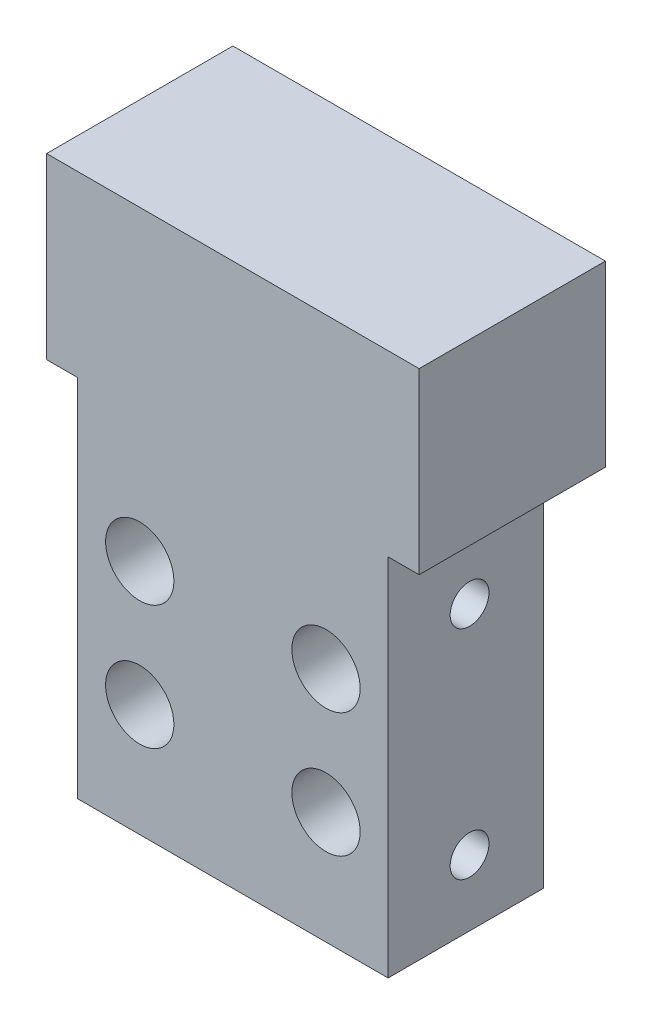
ISO-10303-21;
HEADER;
FILE_DESCRIPTION(('STEP AP214'),'2;1');
FILE_NAME('part.step','',(''),(''),'','','');
FILE_SCHEMA(('AUTOMOTIVE_DESIGN { 1 0 10303 214 1 1 1 1 }'));
ENDSEC;
DATA;
#1=APPLICATION_CONTEXT('core data for automotive mechanical design processes');
#2=APPLICATION_PROTOCOL_DEFINITION('international standard','automotive_design',2000,#1);
#3=PRODUCT_CONTEXT('',#1,'mechanical');
#4=PRODUCT('Part','Part','',(#3));
#5=PRODUCT_RELATED_PRODUCT_CATEGORY('part','',(#4));
#6=PRODUCT_DEFINITION_FORMATION('','',#4);
#7=PRODUCT_DEFINITION_CONTEXT('part definition',#1,'design');
#8=PRODUCT_DEFINITION('design','',#6,#7);
#9=PRODUCT_DEFINITION_SHAPE('','',#8);
#10=(LENGTH_UNIT() NAMED_UNIT(*) SI_UNIT(.MILLI.,.METRE.));
#11=(NAMED_UNIT(*) PLANE_ANGLE_UNIT() SI_UNIT($,.RADIAN.));
#12=(NAMED_UNIT(*) SI_UNIT($,.STERADIAN.) SOLID_ANGLE_UNIT());
#13=UNCERTAINTY_MEASURE_WITH_UNIT(LENGTH_MEASURE(1.E-05),#10,'distance_accuracy_value','');
#14=(GEOMETRIC_REPRESENTATION_CONTEXT(3) GLOBAL_UNCERTAINTY_ASSIGNED_CONTEXT((#13)) GLOBAL_UNIT_ASSIGNED_CONTEXT((#10,
#11,#12)) REPRESENTATION_CONTEXT('',''));
#15=CARTESIAN_POINT('',(0.,0.,0.));
#16=DIRECTION('',(0.,0.,1.));
#17=DIRECTION('',(1.,0.,0.));
#18=AXIS2_PLACEMENT_3D('',#15,#16,#17);
#19=CARTESIAN_POINT('',(0.,0.,10.));
#20=DIRECTION('',(1.,0.,0.));
#21=DIRECTION('',(0.,1.,0.));
#22=AXIS2_PLACEMENT_3D('',#19,#20,#21);
#23=PLANE('',#22);
#24=CARTESIAN_POINT('',(0.,18.25,4.75184368188925));
#25=DIRECTION('',(-1.,0.,0.));
#26=DIRECTION('',(0.,0.,1.));
#27=AXIS2_PLACEMENT_3D('',#24,#25,#26);
#28=CIRCLE('',#27,1.24999999999999);
#29=CARTESIAN_POINT('',(0.,18.25,6.00184368188924));
#30=VERTEX_POINT('',#29);
#31=EDGE_CURVE('E243',#30,#30,#28,.T.);
#32=ORIENTED_EDGE('',*,*,#31,.F.);
#33=EDGE_LOOP('',(#32));
#34=FACE_BOUND('',#33,.T.);
#35=CARTESIAN_POINT('',(0.,4.25000000000001,4.75184368188906));
#36=DIRECTION('',(-1.,0.,0.));
#37=DIRECTION('',(0.,0.,1.));
#38=AXIS2_PLACEMENT_3D('',#35,#36,#37);
#39=CIRCLE('',#38,1.24999999999999);
#40=CARTESIAN_POINT('',(0.,4.25000000000001,6.00184368188905));
#41=VERTEX_POINT('',#40);
#42=EDGE_CURVE('E235',#41,#41,#39,.T.);
#43=ORIENTED_EDGE('',*,*,#42,.F.);
#44=EDGE_LOOP('',(#43));
#45=FACE_BOUND('',#44,.T.);
#46=DIRECTION('',(0.,-1.,0.));
#47=VECTOR('',#46,1.);
#48=CARTESIAN_POINT('',(0.,0.,0.));
#49=LINE('',#48,#47);
#50=CARTESIAN_POINT('',(0.,23.5,0.));
#51=VERTEX_POINT('',#50);
#52=CARTESIAN_POINT('',(0.,0.,0.));
#53=VERTEX_POINT('',#52);
#54=EDGE_CURVE('E91',#51,#53,#49,.T.);
#55=ORIENTED_EDGE('',*,*,#54,.T.);
#56=DIRECTION('',(0.,0.,-1.));
#57=VECTOR('',#56,1.);
#58=CARTESIAN_POINT('',(0.,0.,10.));
#59=LINE('',#58,#57);
#60=CARTESIAN_POINT('',(0.,0.,10.));
#61=VERTEX_POINT('',#60);
#62=EDGE_CURVE('E11',#61,#53,#59,.T.);
#63=ORIENTED_EDGE('',*,*,#62,.F.);
#64=DIRECTION('',(0.,-1.,0.));
#65=VECTOR('',#64,1.);
#66=CARTESIAN_POINT('',(0.,0.,10.));
#67=LINE('',#66,#65);
#68=CARTESIAN_POINT('',(0.,23.5,10.));
#69=VERTEX_POINT('',#68);
#70=EDGE_CURVE('E106',#69,#61,#67,.T.);
#71=ORIENTED_EDGE('',*,*,#70,.F.);
#72=DIRECTION('',(0.,0.,1.));
#73=VECTOR('',#72,1.);
#74=CARTESIAN_POINT('',(0.,23.5,0.));
#75=LINE('',#74,#73);
#76=EDGE_CURVE('E266',#51,#69,#75,.T.);
#77=ORIENTED_EDGE('',*,*,#76,.F.);
#78=EDGE_LOOP('',(#55,#63,#71,#77));
#79=FACE_BOUND('',#78,.T.);
#80=ADVANCED_FACE('F38',(#34,#45,#79),#23,.F.);
#81=CARTESIAN_POINT('',(0.,0.,10.));
#82=DIRECTION('',(0.,1.,0.));
#83=DIRECTION('',(0.,0.,1.));
#84=AXIS2_PLACEMENT_3D('',#81,#82,#83);
#85=PLANE('',#84);
#86=DIRECTION('',(1.,0.,0.));
#87=VECTOR('',#86,1.);
#88=CARTESIAN_POINT('',(0.,0.,0.));
#89=LINE('',#88,#87);
#90=CARTESIAN_POINT('',(20.,0.,0.));
#91=VERTEX_POINT('',#90);
#92=EDGE_CURVE('E80',#53,#91,#89,.T.);
#93=ORIENTED_EDGE('',*,*,#92,.T.);
#94=DIRECTION('',(0.,0.,-1.));
#95=VECTOR('',#94,1.);
#96=CARTESIAN_POINT('',(20.,0.,10.));
#97=LINE('',#96,#95);
#98=CARTESIAN_POINT('',(20.,0.,10.));
#99=VERTEX_POINT('',#98);
#100=EDGE_CURVE('E46',#99,#91,#97,.T.);
#101=ORIENTED_EDGE('',*,*,#100,.F.);
#102=DIRECTION('',(1.,0.,0.));
#103=VECTOR('',#102,1.);
#104=CARTESIAN_POINT('',(0.,0.,10.));
#105=LINE('',#104,#103);
#106=EDGE_CURVE('E68',#61,#99,#105,.T.);
#107=ORIENTED_EDGE('',*,*,#106,.F.);
#108=ORIENTED_EDGE('',*,*,#62,.T.);
#109=EDGE_LOOP('',(#93,#101,#107,#108));
#110=FACE_BOUND('',#109,.T.);
#111=ADVANCED_FACE('F82',(#110),#85,.F.);
#112=CARTESIAN_POINT('',(20.,0.,10.));
#113=DIRECTION('',(-1.,0.,0.));
#114=DIRECTION('',(0.,-1.,0.));
#115=AXIS2_PLACEMENT_3D('',#112,#113,#114);
#116=PLANE('',#115);
#117=CARTESIAN_POINT('',(20.,18.25,4.75184368188925));
#118=DIRECTION('',(1.,0.,0.));
#119=DIRECTION('',(0.,0.,-1.));
#120=AXIS2_PLACEMENT_3D('',#117,#118,#119);
#121=CIRCLE('',#120,1.24999999999999);
#122=CARTESIAN_POINT('',(20.,18.25,3.50184368188926));
#123=VERTEX_POINT('',#122);
#124=EDGE_CURVE('E227',#123,#123,#121,.T.);
#125=ORIENTED_EDGE('',*,*,#124,.F.);
#126=EDGE_LOOP('',(#125));
#127=FACE_BOUND('',#126,.T.);
#128=CARTESIAN_POINT('',(20.,4.25000000000002,4.75184368188906));
#129=DIRECTION('',(1.,0.,0.));
#130=DIRECTION('',(0.,0.,-1.));
#131=AXIS2_PLACEMENT_3D('',#128,#129,#130);
#132=CIRCLE('',#131,1.24999999999999);
#133=CARTESIAN_POINT('',(20.,4.25000000000002,3.50184368188908));
#134=VERTEX_POINT('',#133);
#135=EDGE_CURVE('E219',#134,#134,#132,.T.);
#136=ORIENTED_EDGE('',*,*,#135,.F.);
#137=EDGE_LOOP('',(#136));
#138=FACE_BOUND('',#137,.T.);
#139=DIRECTION('',(0.,1.,0.));
#140=VECTOR('',#139,1.);
#141=CARTESIAN_POINT('',(20.,0.,0.));
#142=LINE('',#141,#140);
#143=CARTESIAN_POINT('',(20.,23.5,0.));
#144=VERTEX_POINT('',#143);
#145=EDGE_CURVE('E90',#91,#144,#142,.T.);
#146=ORIENTED_EDGE('',*,*,#145,.T.);
#147=DIRECTION('',(0.,0.,-1.));
#148=VECTOR('',#147,1.);
#149=CARTESIAN_POINT('',(20.,23.5,10.));
#150=LINE('',#149,#148);
#151=CARTESIAN_POINT('',(20.,23.5,10.));
#152=VERTEX_POINT('',#151);
#153=EDGE_CURVE('E247',#152,#144,#150,.T.);
#154=ORIENTED_EDGE('',*,*,#153,.F.);
#155=DIRECTION('',(0.,1.,0.));
#156=VECTOR('',#155,1.);
#157=CARTESIAN_POINT('',(20.,0.,10.));
#158=LINE('',#157,#156);
#159=EDGE_CURVE('E99',#99,#152,#158,.T.);
#160=ORIENTED_EDGE('',*,*,#159,.F.);
#161=ORIENTED_EDGE('',*,*,#100,.T.);
#162=EDGE_LOOP('',(#146,#154,#160,#161));
#163=FACE_BOUND('',#162,.T.);
#164=ADVANCED_FACE('F95',(#127,#138,#163),#116,.F.);
#165=CARTESIAN_POINT('',(0.,0.,10.));
#166=DIRECTION('',(0.,0.,-1.));
#167=DIRECTION('',(-1.,0.,0.));
#168=AXIS2_PLACEMENT_3D('',#165,#166,#167);
#169=PLANE('',#168);
#170=CARTESIAN_POINT('',(3.99999999999999,15.25,10.));
#171=DIRECTION('',(0.,0.,1.));
#172=DIRECTION('',(1.,0.,0.));
#173=AXIS2_PLACEMENT_3D('',#170,#171,#172);
#174=CIRCLE('',#173,2.2);
#175=CARTESIAN_POINT('',(6.19999999999999,15.25,10.));
#176=VERTEX_POINT('',#175);
#177=EDGE_CURVE('E179',#176,#176,#174,.T.);
#178=ORIENTED_EDGE('',*,*,#177,.F.);
#179=EDGE_LOOP('',(#178));
#180=FACE_BOUND('',#179,.T.);
#181=CARTESIAN_POINT('',(16.,15.25,10.));
#182=DIRECTION('',(0.,0.,1.));
#183=DIRECTION('',(1.,0.,0.));
#184=AXIS2_PLACEMENT_3D('',#181,#182,#183);
#185=CIRCLE('',#184,2.2);
#186=CARTESIAN_POINT('',(18.2,15.25,10.));
#187=VERTEX_POINT('',#186);
#188=EDGE_CURVE('E163',#187,#187,#185,.T.);
#189=ORIENTED_EDGE('',*,*,#188,.F.);
#190=EDGE_LOOP('',(#189));
#191=FACE_BOUND('',#190,.T.);
#192=CARTESIAN_POINT('',(16.0000000000001,7.25,10.));
#193=DIRECTION('',(0.,0.,1.));
#194=DIRECTION('',(1.,0.,0.));
#195=AXIS2_PLACEMENT_3D('',#192,#193,#194);
#196=CIRCLE('',#195,2.2);
#197=CARTESIAN_POINT('',(18.2000000000001,7.25,10.));
#198=VERTEX_POINT('',#197);
#199=EDGE_CURVE('E147',#198,#198,#196,.T.);
#200=ORIENTED_EDGE('',*,*,#199,.F.);
#201=EDGE_LOOP('',(#200));
#202=FACE_BOUND('',#201,.T.);
#203=CARTESIAN_POINT('',(4.00000000000008,7.25,10.));
#204=DIRECTION('',(0.,0.,1.));
#205=DIRECTION('',(1.,0.,0.));
#206=AXIS2_PLACEMENT_3D('',#203,#204,#205);
#207=CIRCLE('',#206,2.2);
#208=CARTESIAN_POINT('',(6.20000000000008,7.25,10.));
#209=VERTEX_POINT('',#208);
#210=EDGE_CURVE('E131',#209,#209,#207,.T.);
#211=ORIENTED_EDGE('',*,*,#210,.F.);
#212=EDGE_LOOP('',(#211));
#213=FACE_BOUND('',#212,.T.);
#214=DIRECTION('',(-1.,0.,0.));
#215=VECTOR('',#214,1.);
#216=CARTESIAN_POINT('',(0.,23.5,10.));
#217=LINE('',#216,#215);
#218=CARTESIAN_POINT('',(-2.,23.5,10.));
#219=VERTEX_POINT('',#218);
#220=EDGE_CURVE('E56',#69,#219,#217,.T.);
#221=ORIENTED_EDGE('',*,*,#220,.F.);
#222=ORIENTED_EDGE('',*,*,#70,.T.);
#223=ORIENTED_EDGE('',*,*,#106,.T.);
#224=ORIENTED_EDGE('',*,*,#159,.T.);
#225=DIRECTION('',(-1.,0.,0.));
#226=VECTOR('',#225,1.);
#227=CARTESIAN_POINT('',(22.,23.5,10.));
#228=LINE('',#227,#226);
#229=CARTESIAN_POINT('',(22.,23.5,10.));
#230=VERTEX_POINT('',#229);
#231=EDGE_CURVE('E249',#230,#152,#228,.T.);
#232=ORIENTED_EDGE('',*,*,#231,.F.);
#233=DIRECTION('',(0.,-1.,0.));
#234=VECTOR('',#233,1.);
#235=CARTESIAN_POINT('',(22.,35.,10.));
#236=LINE('',#235,#234);
#237=CARTESIAN_POINT('',(22.,35.,10.));
#238=VERTEX_POINT('',#237);
#239=EDGE_CURVE('E195',#238,#230,#236,.T.);
#240=ORIENTED_EDGE('',*,*,#239,.F.);
#241=DIRECTION('',(1.,0.,0.));
#242=VECTOR('',#241,1.);
#243=CARTESIAN_POINT('',(22.,35.,10.));
#244=LINE('',#243,#242);
#245=CARTESIAN_POINT('',(-2.,35.,10.));
#246=VERTEX_POINT('',#245);
#247=EDGE_CURVE('E199',#246,#238,#244,.T.);
#248=ORIENTED_EDGE('',*,*,#247,.F.);
#249=DIRECTION('',(0.,-1.,0.));
#250=VECTOR('',#249,1.);
#251=CARTESIAN_POINT('',(-2.,35.,10.));
#252=LINE('',#251,#250);
#253=EDGE_CURVE('E191',#246,#219,#252,.T.);
#254=ORIENTED_EDGE('',*,*,#253,.T.);
#255=EDGE_LOOP('',(#221,#222,#223,#224,#232,#240,#248,#254));
#256=FACE_BOUND('',#255,.T.);
#257=ADVANCED_FACE('F326',(#180,#191,#202,#213,#256),#169,.F.);
#258=CARTESIAN_POINT('',(0.,0.,0.));
#259=DIRECTION('',(0.,0.,-1.));
#260=DIRECTION('',(-1.,0.,0.));
#261=AXIS2_PLACEMENT_3D('',#258,#259,#260);
#262=PLANE('',#261);
#263=CARTESIAN_POINT('',(3.99999999999999,15.25,0.));
#264=DIRECTION('',(0.,0.,1.));
#265=DIRECTION('',(1.,0.,0.));
#266=AXIS2_PLACEMENT_3D('',#263,#264,#265);
#267=CIRCLE('',#266,1.2);
#268=CARTESIAN_POINT('',(5.19999999999999,15.25,0.));
#269=VERTEX_POINT('',#268);
#270=EDGE_CURVE('E167',#269,#269,#267,.T.);
#271=ORIENTED_EDGE('',*,*,#270,.T.);
#272=EDGE_LOOP('',(#271));
#273=FACE_BOUND('',#272,.T.);
#274=CARTESIAN_POINT('',(16.,15.25,0.));
#275=DIRECTION('',(0.,0.,1.));
#276=DIRECTION('',(1.,0.,0.));
#277=AXIS2_PLACEMENT_3D('',#274,#275,#276);
#278=CIRCLE('',#277,1.2);
#279=CARTESIAN_POINT('',(17.2,15.25,0.));
#280=VERTEX_POINT('',#279);
#281=EDGE_CURVE('E151',#280,#280,#278,.T.);
#282=ORIENTED_EDGE('',*,*,#281,.T.);
#283=EDGE_LOOP('',(#282));
#284=FACE_BOUND('',#283,.T.);
#285=CARTESIAN_POINT('',(16.0000000000001,7.25,0.));
#286=DIRECTION('',(0.,0.,1.));
#287=DIRECTION('',(1.,0.,0.));
#288=AXIS2_PLACEMENT_3D('',#285,#286,#287);
#289=CIRCLE('',#288,1.2);
#290=CARTESIAN_POINT('',(17.2000000000001,7.25,0.));
#291=VERTEX_POINT('',#290);
#292=EDGE_CURVE('E135',#291,#291,#289,.T.);
#293=ORIENTED_EDGE('',*,*,#292,.T.);
#294=EDGE_LOOP('',(#293));
#295=FACE_BOUND('',#294,.T.);
#296=CARTESIAN_POINT('',(4.00000000000008,7.25,0.));
#297=DIRECTION('',(0.,0.,1.));
#298=DIRECTION('',(1.,0.,0.));
#299=AXIS2_PLACEMENT_3D('',#296,#297,#298);
#300=CIRCLE('',#299,1.2);
#301=CARTESIAN_POINT('',(5.20000000000007,7.25,0.));
#302=VERTEX_POINT('',#301);
#303=EDGE_CURVE('E115',#302,#302,#300,.T.);
#304=ORIENTED_EDGE('',*,*,#303,.T.);
#305=EDGE_LOOP('',(#304));
#306=FACE_BOUND('',#305,.T.);
#307=ORIENTED_EDGE('',*,*,#54,.F.);
#308=DIRECTION('',(-1.,0.,0.));
#309=VECTOR('',#308,1.);
#310=CARTESIAN_POINT('',(20.,23.5,0.));
#311=LINE('',#310,#309);
#312=EDGE_CURVE('E103',#144,#51,#311,.T.);
#313=ORIENTED_EDGE('',*,*,#312,.F.);
#314=ORIENTED_EDGE('',*,*,#145,.F.);
#315=ORIENTED_EDGE('',*,*,#92,.F.);
#316=EDGE_LOOP('',(#307,#313,#314,#315));
#317=FACE_BOUND('',#316,.T.);
#318=ADVANCED_FACE('F101',(#273,#284,#295,#306,#317),#262,.T.);
#319=CARTESIAN_POINT('',(4.00000000000008,7.25,10.));
#320=DIRECTION('',(0.,0.,1.));
#321=DIRECTION('',(1.,0.,0.));
#322=AXIS2_PLACEMENT_3D('',#319,#320,#321);
#323=CYLINDRICAL_SURFACE('',#322,1.2);
#324=ORIENTED_EDGE('',*,*,#303,.F.);
#325=EDGE_LOOP('',(#324));
#326=FACE_BOUND('',#325,.T.);
#327=CARTESIAN_POINT('',(4.00000000000008,7.25,6.));
#328=DIRECTION('',(0.,0.,1.));
#329=DIRECTION('',(1.,0.,0.));
#330=AXIS2_PLACEMENT_3D('',#327,#328,#329);
#331=CIRCLE('',#330,1.2);
#332=CARTESIAN_POINT('',(5.20000000000008,7.25,6.));
#333=VERTEX_POINT('',#332);
#334=EDGE_CURVE('E123',#333,#333,#331,.T.);
#335=ORIENTED_EDGE('',*,*,#334,.T.);
#336=EDGE_LOOP('',(#335));
#337=FACE_BOUND('',#336,.T.);
#338=ADVANCED_FACE('F431',(#326,#337),#323,.F.);
#339=CARTESIAN_POINT('',(5.20000000000008,7.25,6.));
#340=DIRECTION('',(0.,0.,-1.));
#341=DIRECTION('',(-1.,0.,0.));
#342=AXIS2_PLACEMENT_3D('',#339,#340,#341);
#343=PLANE('',#342);
#344=ORIENTED_EDGE('',*,*,#334,.F.);
#345=EDGE_LOOP('',(#344));
#346=FACE_BOUND('',#345,.T.);
#347=CARTESIAN_POINT('',(4.00000000000008,7.25,6.));
#348=DIRECTION('',(0.,0.,1.));
#349=DIRECTION('',(1.,0.,0.));
#350=AXIS2_PLACEMENT_3D('',#347,#348,#349);
#351=CIRCLE('',#350,2.2);
#352=CARTESIAN_POINT('',(6.20000000000008,7.25,6.));
#353=VERTEX_POINT('',#352);
#354=EDGE_CURVE('E127',#353,#353,#351,.T.);
#355=ORIENTED_EDGE('',*,*,#354,.T.);
#356=EDGE_LOOP('',(#355));
#357=FACE_BOUND('',#356,.T.);
#358=ADVANCED_FACE('F427',(#346,#357),#343,.F.);
#359=CARTESIAN_POINT('',(4.00000000000008,7.25,10.));
#360=DIRECTION('',(0.,0.,1.));
#361=DIRECTION('',(1.,0.,0.));
#362=AXIS2_PLACEMENT_3D('',#359,#360,#361);
#363=CYLINDRICAL_SURFACE('',#362,2.2);
#364=ORIENTED_EDGE('',*,*,#354,.F.);
#365=EDGE_LOOP('',(#364));
#366=FACE_BOUND('',#365,.T.);
#367=ORIENTED_EDGE('',*,*,#210,.T.);
#368=EDGE_LOOP('',(#367));
#369=FACE_BOUND('',#368,.T.);
#370=ADVANCED_FACE('F423',(#366,#369),#363,.F.);
#371=CARTESIAN_POINT('',(16.0000000000001,7.25,10.));
#372=DIRECTION('',(0.,0.,1.));
#373=DIRECTION('',(1.,0.,0.));
#374=AXIS2_PLACEMENT_3D('',#371,#372,#373);
#375=CYLINDRICAL_SURFACE('',#374,1.2);
#376=ORIENTED_EDGE('',*,*,#292,.F.);
#377=EDGE_LOOP('',(#376));
#378=FACE_BOUND('',#377,.T.);
#379=CARTESIAN_POINT('',(16.0000000000001,7.25,6.));
#380=DIRECTION('',(0.,0.,1.));
#381=DIRECTION('',(1.,0.,0.));
#382=AXIS2_PLACEMENT_3D('',#379,#380,#381);
#383=CIRCLE('',#382,1.2);
#384=CARTESIAN_POINT('',(17.2000000000001,7.25,6.));
#385=VERTEX_POINT('',#384);
#386=EDGE_CURVE('E139',#385,#385,#383,.T.);
#387=ORIENTED_EDGE('',*,*,#386,.T.);
#388=EDGE_LOOP('',(#387));
#389=FACE_BOUND('',#388,.T.);
#390=ADVANCED_FACE('F419',(#378,#389),#375,.F.);
#391=CARTESIAN_POINT('',(17.2000000000001,7.25,6.));
#392=DIRECTION('',(0.,0.,-1.));
#393=DIRECTION('',(-1.,0.,0.));
#394=AXIS2_PLACEMENT_3D('',#391,#392,#393);
#395=PLANE('',#394);
#396=ORIENTED_EDGE('',*,*,#386,.F.);
#397=EDGE_LOOP('',(#396));
#398=FACE_BOUND('',#397,.T.);
#399=CARTESIAN_POINT('',(16.0000000000001,7.25,6.));
#400=DIRECTION('',(0.,0.,1.));
#401=DIRECTION('',(1.,0.,0.));
#402=AXIS2_PLACEMENT_3D('',#399,#400,#401);
#403=CIRCLE('',#402,2.2);
#404=CARTESIAN_POINT('',(18.2000000000001,7.25,6.));
#405=VERTEX_POINT('',#404);
#406=EDGE_CURVE('E143',#405,#405,#403,.T.);
#407=ORIENTED_EDGE('',*,*,#406,.T.);
#408=EDGE_LOOP('',(#407));
#409=FACE_BOUND('',#408,.T.);
#410=ADVANCED_FACE('F415',(#398,#409),#395,.F.);
#411=CARTESIAN_POINT('',(16.0000000000001,7.25,10.));
#412=DIRECTION('',(0.,0.,1.));
#413=DIRECTION('',(1.,0.,0.));
#414=AXIS2_PLACEMENT_3D('',#411,#412,#413);
#415=CYLINDRICAL_SURFACE('',#414,2.2);
#416=ORIENTED_EDGE('',*,*,#406,.F.);
#417=EDGE_LOOP('',(#416));
#418=FACE_BOUND('',#417,.T.);
#419=ORIENTED_EDGE('',*,*,#199,.T.);
#420=EDGE_LOOP('',(#419));
#421=FACE_BOUND('',#420,.T.);
#422=ADVANCED_FACE('F411',(#418,#421),#415,.F.);
#423=CARTESIAN_POINT('',(16.,15.25,10.));
#424=DIRECTION('',(0.,0.,1.));
#425=DIRECTION('',(1.,0.,0.));
#426=AXIS2_PLACEMENT_3D('',#423,#424,#425);
#427=CYLINDRICAL_SURFACE('',#426,1.2);
#428=ORIENTED_EDGE('',*,*,#281,.F.);
#429=EDGE_LOOP('',(#428));
#430=FACE_BOUND('',#429,.T.);
#431=CARTESIAN_POINT('',(16.,15.25,6.));
#432=DIRECTION('',(0.,0.,1.));
#433=DIRECTION('',(1.,0.,0.));
#434=AXIS2_PLACEMENT_3D('',#431,#432,#433);
#435=CIRCLE('',#434,1.2);
#436=CARTESIAN_POINT('',(17.2,15.25,6.));
#437=VERTEX_POINT('',#436);
#438=EDGE_CURVE('E155',#437,#437,#435,.T.);
#439=ORIENTED_EDGE('',*,*,#438,.T.);
#440=EDGE_LOOP('',(#439));
#441=FACE_BOUND('',#440,.T.);
#442=ADVANCED_FACE('F407',(#430,#441),#427,.F.);
#443=CARTESIAN_POINT('',(17.2,15.25,6.));
#444=DIRECTION('',(0.,0.,-1.));
#445=DIRECTION('',(-1.,0.,0.));
#446=AXIS2_PLACEMENT_3D('',#443,#444,#445);
#447=PLANE('',#446);
#448=ORIENTED_EDGE('',*,*,#438,.F.);
#449=EDGE_LOOP('',(#448));
#450=FACE_BOUND('',#449,.T.);
#451=CARTESIAN_POINT('',(16.,15.25,6.));
#452=DIRECTION('',(0.,0.,1.));
#453=DIRECTION('',(1.,0.,0.));
#454=AXIS2_PLACEMENT_3D('',#451,#452,#453);
#455=CIRCLE('',#454,2.2);
#456=CARTESIAN_POINT('',(18.2,15.25,6.));
#457=VERTEX_POINT('',#456);
#458=EDGE_CURVE('E159',#457,#457,#455,.T.);
#459=ORIENTED_EDGE('',*,*,#458,.T.);
#460=EDGE_LOOP('',(#459));
#461=FACE_BOUND('',#460,.T.);
#462=ADVANCED_FACE('F403',(#450,#461),#447,.F.);
#463=CARTESIAN_POINT('',(16.,15.25,10.));
#464=DIRECTION('',(0.,0.,1.));
#465=DIRECTION('',(1.,0.,0.));
#466=AXIS2_PLACEMENT_3D('',#463,#464,#465);
#467=CYLINDRICAL_SURFACE('',#466,2.2);
#468=ORIENTED_EDGE('',*,*,#458,.F.);
#469=EDGE_LOOP('',(#468));
#470=FACE_BOUND('',#469,.T.);
#471=ORIENTED_EDGE('',*,*,#188,.T.);
#472=EDGE_LOOP('',(#471));
#473=FACE_BOUND('',#472,.T.);
#474=ADVANCED_FACE('F399',(#470,#473),#467,.F.);
#475=CARTESIAN_POINT('',(3.99999999999999,15.25,10.));
#476=DIRECTION('',(0.,0.,1.));
#477=DIRECTION('',(1.,0.,0.));
#478=AXIS2_PLACEMENT_3D('',#475,#476,#477);
#479=CYLINDRICAL_SURFACE('',#478,1.2);
#480=ORIENTED_EDGE('',*,*,#270,.F.);
#481=EDGE_LOOP('',(#480));
#482=FACE_BOUND('',#481,.T.);
#483=CARTESIAN_POINT('',(3.99999999999999,15.25,6.));
#484=DIRECTION('',(0.,0.,1.));
#485=DIRECTION('',(1.,0.,0.));
#486=AXIS2_PLACEMENT_3D('',#483,#484,#485);
#487=CIRCLE('',#486,1.2);
#488=CARTESIAN_POINT('',(5.19999999999999,15.25,6.));
#489=VERTEX_POINT('',#488);
#490=EDGE_CURVE('E171',#489,#489,#487,.T.);
#491=ORIENTED_EDGE('',*,*,#490,.T.);
#492=EDGE_LOOP('',(#491));
#493=FACE_BOUND('',#492,.T.);
#494=ADVANCED_FACE('F395',(#482,#493),#479,.F.);
#495=CARTESIAN_POINT('',(5.19999999999999,15.25,6.));
#496=DIRECTION('',(0.,0.,-1.));
#497=DIRECTION('',(-1.,0.,0.));
#498=AXIS2_PLACEMENT_3D('',#495,#496,#497);
#499=PLANE('',#498);
#500=ORIENTED_EDGE('',*,*,#490,.F.);
#501=EDGE_LOOP('',(#500));
#502=FACE_BOUND('',#501,.T.);
#503=CARTESIAN_POINT('',(3.99999999999999,15.25,6.));
#504=DIRECTION('',(0.,0.,1.));
#505=DIRECTION('',(1.,0.,0.));
#506=AXIS2_PLACEMENT_3D('',#503,#504,#505);
#507=CIRCLE('',#506,2.2);
#508=CARTESIAN_POINT('',(6.19999999999999,15.25,6.));
#509=VERTEX_POINT('',#508);
#510=EDGE_CURVE('E175',#509,#509,#507,.T.);
#511=ORIENTED_EDGE('',*,*,#510,.T.);
#512=EDGE_LOOP('',(#511));
#513=FACE_BOUND('',#512,.T.);
#514=ADVANCED_FACE('F391',(#502,#513),#499,.F.);
#515=CARTESIAN_POINT('',(3.99999999999999,15.25,10.));
#516=DIRECTION('',(0.,0.,1.));
#517=DIRECTION('',(1.,0.,0.));
#518=AXIS2_PLACEMENT_3D('',#515,#516,#517);
#519=CYLINDRICAL_SURFACE('',#518,2.2);
#520=ORIENTED_EDGE('',*,*,#510,.F.);
#521=EDGE_LOOP('',(#520));
#522=FACE_BOUND('',#521,.T.);
#523=ORIENTED_EDGE('',*,*,#177,.T.);
#524=EDGE_LOOP('',(#523));
#525=FACE_BOUND('',#524,.T.);
#526=ADVANCED_FACE('F388',(#522,#525),#519,.F.);
#527=CARTESIAN_POINT('',(22.,35.,-2.));
#528=DIRECTION('',(-1.,0.,0.));
#529=DIRECTION('',(0.,0.,1.));
#530=AXIS2_PLACEMENT_3D('',#527,#528,#529);
#531=PLANE('',#530);
#532=ORIENTED_EDGE('',*,*,#239,.T.);
#533=DIRECTION('',(0.,0.,1.));
#534=VECTOR('',#533,1.);
#535=CARTESIAN_POINT('',(22.,23.5,-2.));
#536=LINE('',#535,#534);
#537=CARTESIAN_POINT('',(22.,23.5,-2.));
#538=VERTEX_POINT('',#537);
#539=EDGE_CURVE('E253',#538,#230,#536,.T.);
#540=ORIENTED_EDGE('',*,*,#539,.F.);
#541=DIRECTION('',(0.,-1.,0.));
#542=VECTOR('',#541,1.);
#543=CARTESIAN_POINT('',(22.,35.,-2.));
#544=LINE('',#543,#542);
#545=CARTESIAN_POINT('',(22.,35.,-2.));
#546=VERTEX_POINT('',#545);
#547=EDGE_CURVE('E183',#546,#538,#544,.T.);
#548=ORIENTED_EDGE('',*,*,#547,.F.);
#549=DIRECTION('',(0.,0.,-1.));
#550=VECTOR('',#549,1.);
#551=CARTESIAN_POINT('',(22.,35.,-2.));
#552=LINE('',#551,#550);
#553=EDGE_CURVE('E211',#238,#546,#552,.T.);
#554=ORIENTED_EDGE('',*,*,#553,.F.);
#555=EDGE_LOOP('',(#532,#540,#548,#554));
#556=FACE_BOUND('',#555,.T.);
#557=ADVANCED_FACE('F329',(#556),#531,.F.);
#558=CARTESIAN_POINT('',(22.,35.,-2.));
#559=DIRECTION('',(0.,0.,1.));
#560=DIRECTION('',(1.,0.,0.));
#561=AXIS2_PLACEMENT_3D('',#558,#559,#560);
#562=PLANE('',#561);
#563=ORIENTED_EDGE('',*,*,#547,.T.);
#564=DIRECTION('',(1.,0.,0.));
#565=VECTOR('',#564,1.);
#566=CARTESIAN_POINT('',(-2.,23.5,-2.));
#567=LINE('',#566,#565);
#568=CARTESIAN_POINT('',(-2.,23.5,-2.));
#569=VERTEX_POINT('',#568);
#570=EDGE_CURVE('E257',#569,#538,#567,.T.);
#571=ORIENTED_EDGE('',*,*,#570,.F.);
#572=DIRECTION('',(0.,-1.,0.));
#573=VECTOR('',#572,1.);
#574=CARTESIAN_POINT('',(-2.,35.,-2.));
#575=LINE('',#574,#573);
#576=CARTESIAN_POINT('',(-2.,35.,-2.));
#577=VERTEX_POINT('',#576);
#578=EDGE_CURVE('E187',#577,#569,#575,.T.);
#579=ORIENTED_EDGE('',*,*,#578,.F.);
#580=DIRECTION('',(-1.,0.,0.));
#581=VECTOR('',#580,1.);
#582=CARTESIAN_POINT('',(22.,35.,-2.));
#583=LINE('',#582,#581);
#584=EDGE_CURVE('E207',#546,#577,#583,.T.);
#585=ORIENTED_EDGE('',*,*,#584,.F.);
#586=EDGE_LOOP('',(#563,#571,#579,#585));
#587=FACE_BOUND('',#586,.T.);
#588=ADVANCED_FACE('F332',(#587),#562,.F.);
#589=CARTESIAN_POINT('',(-2.,35.,-2.));
#590=DIRECTION('',(1.,0.,0.));
#591=DIRECTION('',(0.,0.,-1.));
#592=AXIS2_PLACEMENT_3D('',#589,#590,#591);
#593=PLANE('',#592);
#594=ORIENTED_EDGE('',*,*,#578,.T.);
#595=DIRECTION('',(0.,0.,-1.));
#596=VECTOR('',#595,1.);
#597=CARTESIAN_POINT('',(-2.,23.5,10.));
#598=LINE('',#597,#596);
#599=EDGE_CURVE('E261',#219,#569,#598,.T.);
#600=ORIENTED_EDGE('',*,*,#599,.F.);
#601=ORIENTED_EDGE('',*,*,#253,.F.);
#602=DIRECTION('',(0.,0.,1.));
#603=VECTOR('',#602,1.);
#604=CARTESIAN_POINT('',(-2.,35.,-2.));
#605=LINE('',#604,#603);
#606=EDGE_CURVE('E203',#577,#246,#605,.T.);
#607=ORIENTED_EDGE('',*,*,#606,.F.);
#608=EDGE_LOOP('',(#594,#600,#601,#607));
#609=FACE_BOUND('',#608,.T.);
#610=ADVANCED_FACE('F335',(#609),#593,.F.);
#611=CARTESIAN_POINT('',(0.,35.,0.));
#612=DIRECTION('',(0.,-1.,0.));
#613=DIRECTION('',(0.,0.,-1.));
#614=AXIS2_PLACEMENT_3D('',#611,#612,#613);
#615=PLANE('',#614);
#616=ORIENTED_EDGE('',*,*,#553,.T.);
#617=ORIENTED_EDGE('',*,*,#584,.T.);
#618=ORIENTED_EDGE('',*,*,#606,.T.);
#619=ORIENTED_EDGE('',*,*,#247,.T.);
#620=EDGE_LOOP('',(#616,#617,#618,#619));
#621=FACE_BOUND('',#620,.T.);
#622=ADVANCED_FACE('F320',(#621),#615,.F.);
#623=CARTESIAN_POINT('',(16.,4.25000000000002,4.75184368188906));
#624=DIRECTION('',(1.,0.,0.));
#625=DIRECTION('',(0.,0.,-1.));
#626=AXIS2_PLACEMENT_3D('',#623,#624,#625);
#627=CONICAL_SURFACE('',#626,1.25,1.02974425867665);
#628=CARTESIAN_POINT('',(15.2489242262156,4.25000000000002,4.75184368188906));
#629=VERTEX_POINT('',#628);
#630=VERTEX_LOOP('',#629);
#631=FACE_BOUND('',#630,.T.);
#632=CARTESIAN_POINT('',(16.,4.25000000000002,4.75184368188906));
#633=DIRECTION('',(1.,0.,0.));
#634=DIRECTION('',(0.,0.,-1.));
#635=AXIS2_PLACEMENT_3D('',#632,#633,#634);
#636=CIRCLE('',#635,1.25);
#637=CARTESIAN_POINT('',(16.,4.25000000000002,3.50184368188907));
#638=VERTEX_POINT('',#637);
#639=EDGE_CURVE('E215',#638,#638,#636,.T.);
#640=ORIENTED_EDGE('',*,*,#639,.T.);
#641=EDGE_LOOP('',(#640));
#642=FACE_BOUND('',#641,.T.);
#643=ADVANCED_FACE('F375',(#631,#642),#627,.F.);
#644=CARTESIAN_POINT('',(20.,4.25000000000002,4.75184368188906));
#645=DIRECTION('',(1.,0.,0.));
#646=DIRECTION('',(0.,0.,-1.));
#647=AXIS2_PLACEMENT_3D('',#644,#645,#646);
#648=CYLINDRICAL_SURFACE('',#647,1.24999999999999);
#649=ORIENTED_EDGE('',*,*,#639,.F.);
#650=EDGE_LOOP('',(#649));
#651=FACE_BOUND('',#650,.T.);
#652=ORIENTED_EDGE('',*,*,#135,.T.);
#653=EDGE_LOOP('',(#652));
#654=FACE_BOUND('',#653,.T.);
#655=ADVANCED_FACE('F371',(#651,#654),#648,.F.);
#656=CARTESIAN_POINT('',(16.,18.25,4.75184368188925));
#657=DIRECTION('',(1.,0.,0.));
#658=DIRECTION('',(0.,0.,-1.));
#659=AXIS2_PLACEMENT_3D('',#656,#657,#658);
#660=CONICAL_SURFACE('',#659,1.25,1.02974425867665);
#661=CARTESIAN_POINT('',(15.2489242262155,18.25,4.75184368188925));
#662=VERTEX_POINT('',#661);
#663=VERTEX_LOOP('',#662);
#664=FACE_BOUND('',#663,.T.);
#665=CARTESIAN_POINT('',(16.,18.25,4.75184368188925));
#666=DIRECTION('',(1.,0.,0.));
#667=DIRECTION('',(0.,0.,-1.));
#668=AXIS2_PLACEMENT_3D('',#665,#666,#667);
#669=CIRCLE('',#668,1.25);
#670=CARTESIAN_POINT('',(16.,18.25,3.50184368188925));
#671=VERTEX_POINT('',#670);
#672=EDGE_CURVE('E223',#671,#671,#669,.T.);
#673=ORIENTED_EDGE('',*,*,#672,.T.);
#674=EDGE_LOOP('',(#673));
#675=FACE_BOUND('',#674,.T.);
#676=ADVANCED_FACE('F367',(#664,#675),#660,.F.);
#677=CARTESIAN_POINT('',(20.,18.25,4.75184368188925));
#678=DIRECTION('',(1.,0.,0.));
#679=DIRECTION('',(0.,0.,-1.));
#680=AXIS2_PLACEMENT_3D('',#677,#678,#679);
#681=CYLINDRICAL_SURFACE('',#680,1.24999999999999);
#682=ORIENTED_EDGE('',*,*,#672,.F.);
#683=EDGE_LOOP('',(#682));
#684=FACE_BOUND('',#683,.T.);
#685=ORIENTED_EDGE('',*,*,#124,.T.);
#686=EDGE_LOOP('',(#685));
#687=FACE_BOUND('',#686,.T.);
#688=ADVANCED_FACE('F359',(#684,#687),#681,.F.);
#689=CARTESIAN_POINT('',(4.,4.25000000000001,4.75184368188906));
#690=DIRECTION('',(-1.,0.,0.));
#691=DIRECTION('',(0.,0.,1.));
#692=AXIS2_PLACEMENT_3D('',#689,#690,#691);
#693=CONICAL_SURFACE('',#692,1.24999999999999,1.02974425867665);
#694=CARTESIAN_POINT('',(4.75107577378444,4.25000000000001,4.75184368188906));
#695=VERTEX_POINT('',#694);
#696=VERTEX_LOOP('',#695);
#697=FACE_BOUND('',#696,.T.);
#698=CARTESIAN_POINT('',(4.,4.25000000000001,4.75184368188906));
#699=DIRECTION('',(-1.,0.,0.));
#700=DIRECTION('',(0.,0.,1.));
#701=AXIS2_PLACEMENT_3D('',#698,#699,#700);
#702=CIRCLE('',#701,1.24999999999999);
#703=CARTESIAN_POINT('',(4.,4.25000000000001,6.00184368188905));
#704=VERTEX_POINT('',#703);
#705=EDGE_CURVE('E231',#704,#704,#702,.T.);
#706=ORIENTED_EDGE('',*,*,#705,.T.);
#707=EDGE_LOOP('',(#706));
#708=FACE_BOUND('',#707,.T.);
#709=ADVANCED_FACE('F349',(#697,#708),#693,.F.);
#710=CARTESIAN_POINT('',(0.,4.25000000000001,4.75184368188906));
#711=DIRECTION('',(-1.,0.,0.));
#712=DIRECTION('',(0.,0.,1.));
#713=AXIS2_PLACEMENT_3D('',#710,#711,#712);
#714=CYLINDRICAL_SURFACE('',#713,1.24999999999999);
#715=ORIENTED_EDGE('',*,*,#705,.F.);
#716=EDGE_LOOP('',(#715));
#717=FACE_BOUND('',#716,.T.);
#718=ORIENTED_EDGE('',*,*,#42,.T.);
#719=EDGE_LOOP('',(#718));
#720=FACE_BOUND('',#719,.T.);
#721=ADVANCED_FACE('F346',(#717,#720),#714,.F.);
#722=CARTESIAN_POINT('',(4.,18.25,4.75184368188925));
#723=DIRECTION('',(-1.,0.,0.));
#724=DIRECTION('',(0.,0.,1.));
#725=AXIS2_PLACEMENT_3D('',#722,#723,#724);
#726=CONICAL_SURFACE('',#725,1.24999999999999,1.02974425867665);
#727=CARTESIAN_POINT('',(4.75107577378444,18.25,4.75184368188925));
#728=VERTEX_POINT('',#727);
#729=VERTEX_LOOP('',#728);
#730=FACE_BOUND('',#729,.T.);
#731=CARTESIAN_POINT('',(4.,18.25,4.75184368188925));
#732=DIRECTION('',(-1.,0.,0.));
#733=DIRECTION('',(0.,0.,1.));
#734=AXIS2_PLACEMENT_3D('',#731,#732,#733);
#735=CIRCLE('',#734,1.24999999999999);
#736=CARTESIAN_POINT('',(4.,18.25,6.00184368188924));
#737=VERTEX_POINT('',#736);
#738=EDGE_CURVE('E239',#737,#737,#735,.T.);
#739=ORIENTED_EDGE('',*,*,#738,.T.);
#740=EDGE_LOOP('',(#739));
#741=FACE_BOUND('',#740,.T.);
#742=ADVANCED_FACE('F348',(#730,#741),#726,.F.);
#743=CARTESIAN_POINT('',(0.,18.25,4.75184368188925));
#744=DIRECTION('',(-1.,0.,0.));
#745=DIRECTION('',(0.,0.,1.));
#746=AXIS2_PLACEMENT_3D('',#743,#744,#745);
#747=CYLINDRICAL_SURFACE('',#746,1.24999999999999);
#748=ORIENTED_EDGE('',*,*,#738,.F.);
#749=EDGE_LOOP('',(#748));
#750=FACE_BOUND('',#749,.T.);
#751=ORIENTED_EDGE('',*,*,#31,.T.);
#752=EDGE_LOOP('',(#751));
#753=FACE_BOUND('',#752,.T.);
#754=ADVANCED_FACE('F356',(#750,#753),#747,.F.);
#755=CARTESIAN_POINT('',(0.,23.5,0.));
#756=DIRECTION('',(0.,1.,0.));
#757=DIRECTION('',(0.,0.,1.));
#758=AXIS2_PLACEMENT_3D('',#755,#756,#757);
#759=PLANE('',#758);
#760=ORIENTED_EDGE('',*,*,#312,.T.);
#761=ORIENTED_EDGE('',*,*,#76,.T.);
#762=ORIENTED_EDGE('',*,*,#220,.T.);
#763=ORIENTED_EDGE('',*,*,#599,.T.);
#764=ORIENTED_EDGE('',*,*,#570,.T.);
#765=ORIENTED_EDGE('',*,*,#539,.T.);
#766=ORIENTED_EDGE('',*,*,#231,.T.);
#767=ORIENTED_EDGE('',*,*,#153,.T.);
#768=EDGE_LOOP('',(#760,#761,#762,#763,#764,#765,#766,#767));
#769=FACE_BOUND('',#768,.T.);
#770=ADVANCED_FACE('F270',(#769),#759,.F.);
#771=CLOSED_SHELL('',(#80,#111,#164,#257,#318,#338,#358,#370,#390,#410,#422,#442,#462,#474,#494,
#514,#526,#557,#588,#610,#622,#643,#655,#676,#688,#709,#721,#742,#754,#770));
#772=MANIFOLD_SOLID_BREP('B2',#771);
#773=ADVANCED_BREP_SHAPE_REPRESENTATION('',(#18,#772),#14);
#774=SHAPE_DEFINITION_REPRESENTATION(#9,#773);
ENDSEC;
END-ISO-10303-21;
